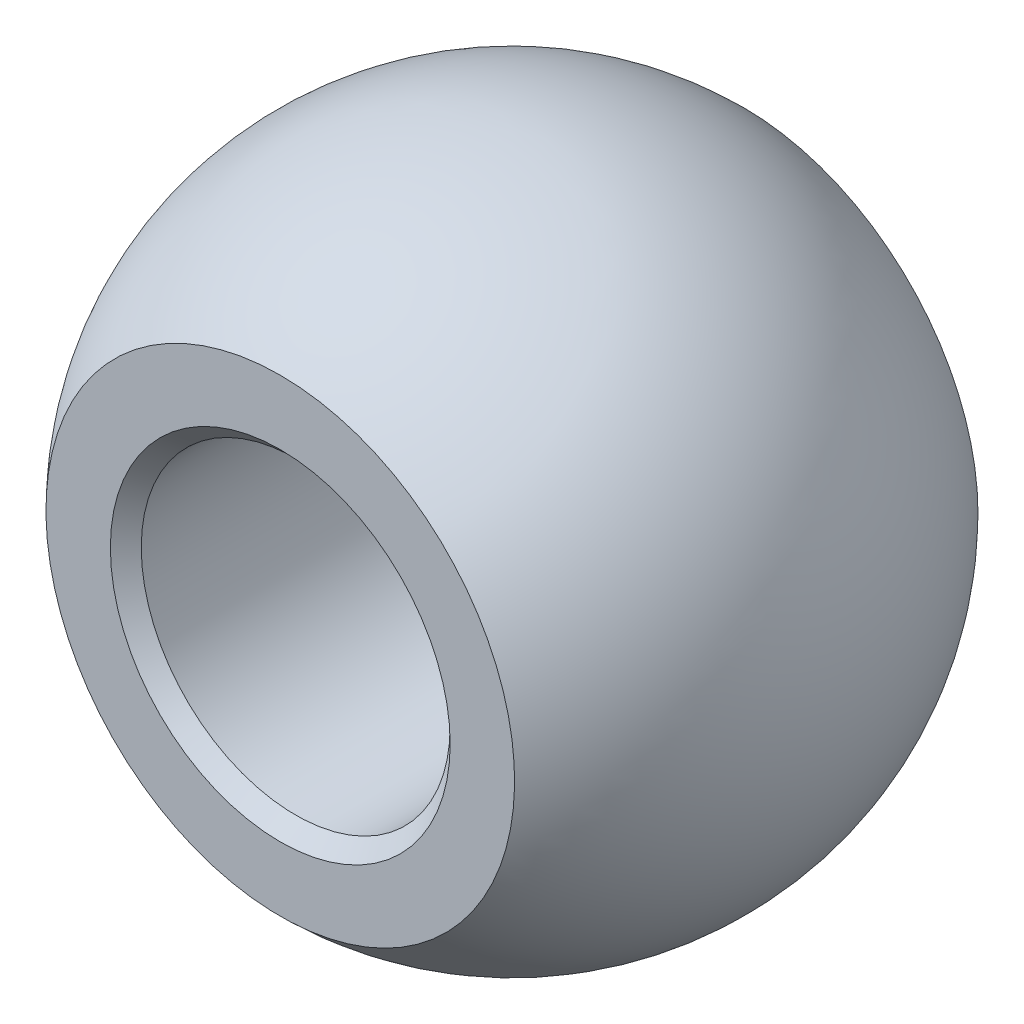
ISO-10303-21;
HEADER;
FILE_DESCRIPTION(('STEP AP214'),'2;1');
FILE_NAME('part.step','',(''),(''),'','','');
FILE_SCHEMA(('AUTOMOTIVE_DESIGN { 1 0 10303 214 1 1 1 1 }'));
ENDSEC;
DATA;
#1=APPLICATION_CONTEXT('core data for automotive mechanical design processes');
#2=APPLICATION_PROTOCOL_DEFINITION('international standard','automotive_design',2000,#1);
#3=PRODUCT_CONTEXT('',#1,'mechanical');
#4=PRODUCT('Part','Part','',(#3));
#5=PRODUCT_RELATED_PRODUCT_CATEGORY('part','',(#4));
#6=PRODUCT_DEFINITION_FORMATION('','',#4);
#7=PRODUCT_DEFINITION_CONTEXT('part definition',#1,'design');
#8=PRODUCT_DEFINITION('design','',#6,#7);
#9=PRODUCT_DEFINITION_SHAPE('','',#8);
#10=(LENGTH_UNIT() NAMED_UNIT(*) SI_UNIT(.MILLI.,.METRE.));
#11=(NAMED_UNIT(*) PLANE_ANGLE_UNIT() SI_UNIT($,.RADIAN.));
#12=(NAMED_UNIT(*) SI_UNIT($,.STERADIAN.) SOLID_ANGLE_UNIT());
#13=UNCERTAINTY_MEASURE_WITH_UNIT(LENGTH_MEASURE(1.E-05),#10,'distance_accuracy_value','');
#14=(GEOMETRIC_REPRESENTATION_CONTEXT(3) GLOBAL_UNCERTAINTY_ASSIGNED_CONTEXT((#13)) GLOBAL_UNIT_ASSIGNED_CONTEXT((#10,
#11,#12)) REPRESENTATION_CONTEXT('',''));
#15=CARTESIAN_POINT('',(0.,0.,0.));
#16=DIRECTION('',(0.,0.,1.));
#17=DIRECTION('',(1.,0.,0.));
#18=AXIS2_PLACEMENT_3D('',#15,#16,#17);
#19=CARTESIAN_POINT('',(0.,0.,0.));
#20=DIRECTION('',(0.,1.,0.));
#21=DIRECTION('',(1.,0.,0.));
#22=AXIS2_PLACEMENT_3D('',#19,#20,#21);
#23=SPHERICAL_SURFACE('',#22,6.4);
#24=CARTESIAN_POINT('',(0.,0.,0.));
#25=DIRECTION('',(0.,0.,-1.));
#26=DIRECTION('',(0.,1.,0.));
#27=AXIS2_PLACEMENT_3D('',#24,#25,#26);
#28=SPHERICAL_SURFACE('',#27,6.4);
#29=CARTESIAN_POINT('',(0.,0.,4.5));
#30=DIRECTION('',(0.,0.,-1.));
#31=DIRECTION('',(0.,1.,0.));
#32=AXIS2_PLACEMENT_3D('',#29,#30,#31);
#33=CIRCLE('',#32,4.5508241011931);
#34=CARTESIAN_POINT('',(0.,4.5508241011931,4.5));
#35=VERTEX_POINT('',#34);
#36=EDGE_CURVE('E53',#35,#35,#33,.F.);
#37=ORIENTED_EDGE('',*,*,#36,.F.);
#38=EDGE_LOOP('',(#37));
#39=FACE_BOUND('',#38,.T.);
#40=CARTESIAN_POINT('',(0.,0.,-4.5));
#41=DIRECTION('',(0.,0.,1.));
#42=DIRECTION('',(0.,-1.,0.));
#43=AXIS2_PLACEMENT_3D('',#40,#41,#42);
#44=CIRCLE('',#43,4.5508241011931);
#45=CARTESIAN_POINT('',(0.,-4.5508241011931,-4.5));
#46=VERTEX_POINT('',#45);
#47=EDGE_CURVE('E52',#46,#46,#44,.F.);
#48=ORIENTED_EDGE('',*,*,#47,.F.);
#49=EDGE_LOOP('',(#48));
#50=FACE_BOUND('',#49,.T.);
#51=ADVANCED_FACE('F32',(#39,#50),#28,.T.);
#52=CARTESIAN_POINT('',(-6.4,7.90827763743701,-4.5));
#53=DIRECTION('',(0.,0.,1.));
#54=DIRECTION('',(0.,-1.,0.));
#55=AXIS2_PLACEMENT_3D('',#52,#53,#54);
#56=PLANE('',#55);
#57=CARTESIAN_POINT('',(0.,0.,-4.5));
#58=DIRECTION('',(0.,0.,1.));
#59=DIRECTION('',(0.,-1.,0.));
#60=AXIS2_PLACEMENT_3D('',#57,#58,#59);
#61=CIRCLE('',#60,3.3);
#62=CARTESIAN_POINT('',(0.,-3.3,-4.5));
#63=VERTEX_POINT('',#62);
#64=EDGE_CURVE('E10',#63,#63,#61,.T.);
#65=ORIENTED_EDGE('',*,*,#64,.T.);
#66=EDGE_LOOP('',(#65));
#67=FACE_BOUND('',#66,.T.);
#68=ORIENTED_EDGE('',*,*,#47,.T.);
#69=EDGE_LOOP('',(#68));
#70=FACE_BOUND('',#69,.T.);
#71=ADVANCED_FACE('F59',(#67,#70),#56,.F.);
#72=CARTESIAN_POINT('',(-6.4,8.45041359442809,4.5));
#73=DIRECTION('',(0.,0.,-1.));
#74=DIRECTION('',(0.,1.,0.));
#75=AXIS2_PLACEMENT_3D('',#72,#73,#74);
#76=PLANE('',#75);
#77=CARTESIAN_POINT('',(0.,0.,4.5));
#78=DIRECTION('',(0.,0.,-1.));
#79=DIRECTION('',(0.,1.,0.));
#80=AXIS2_PLACEMENT_3D('',#77,#78,#79);
#81=CIRCLE('',#80,3.3);
#82=CARTESIAN_POINT('',(0.,3.3,4.5));
#83=VERTEX_POINT('',#82);
#84=EDGE_CURVE('E39',#83,#83,#81,.T.);
#85=ORIENTED_EDGE('',*,*,#84,.T.);
#86=EDGE_LOOP('',(#85));
#87=FACE_BOUND('',#86,.T.);
#88=ORIENTED_EDGE('',*,*,#36,.T.);
#89=EDGE_LOOP('',(#88));
#90=FACE_BOUND('',#89,.T.);
#91=ADVANCED_FACE('F67',(#87,#90),#76,.F.);
#92=CARTESIAN_POINT('',(0.,0.,-4.5));
#93=DIRECTION('',(0.,0.,1.));
#94=DIRECTION('',(1.,0.,0.));
#95=AXIS2_PLACEMENT_3D('',#92,#93,#94);
#96=CYLINDRICAL_SURFACE('',#95,3.);
#97=CARTESIAN_POINT('',(0.,0.,4.2));
#98=DIRECTION('',(0.,0.,-1.));
#99=DIRECTION('',(-1.,0.,0.));
#100=AXIS2_PLACEMENT_3D('',#97,#98,#99);
#101=CIRCLE('',#100,3.);
#102=CARTESIAN_POINT('',(-3.,0.,4.2));
#103=VERTEX_POINT('',#102);
#104=EDGE_CURVE('E43',#103,#103,#101,.F.);
#105=ORIENTED_EDGE('',*,*,#104,.T.);
#106=EDGE_LOOP('',(#105));
#107=FACE_BOUND('',#106,.T.);
#108=CARTESIAN_POINT('',(0.,0.,-4.2));
#109=DIRECTION('',(0.,0.,1.));
#110=DIRECTION('',(1.,0.,0.));
#111=AXIS2_PLACEMENT_3D('',#108,#109,#110);
#112=CIRCLE('',#111,3.);
#113=CARTESIAN_POINT('',(3.,0.,-4.2));
#114=VERTEX_POINT('',#113);
#115=EDGE_CURVE('E47',#114,#114,#112,.F.);
#116=ORIENTED_EDGE('',*,*,#115,.T.);
#117=EDGE_LOOP('',(#116));
#118=FACE_BOUND('',#117,.T.);
#119=ADVANCED_FACE('F73',(#107,#118),#96,.F.);
#120=CARTESIAN_POINT('',(0.,0.,4.2));
#121=DIRECTION('',(0.,0.,1.));
#122=DIRECTION('',(1.,0.,0.));
#123=AXIS2_PLACEMENT_3D('',#120,#121,#122);
#124=CONICAL_SURFACE('',#123,3.,0.785398163397457);
#125=ORIENTED_EDGE('',*,*,#84,.F.);
#126=EDGE_LOOP('',(#125));
#127=FACE_BOUND('',#126,.T.);
#128=ORIENTED_EDGE('',*,*,#104,.F.);
#129=EDGE_LOOP('',(#128));
#130=FACE_BOUND('',#129,.T.);
#131=ADVANCED_FACE('F71',(#127,#130),#124,.F.);
#132=CARTESIAN_POINT('',(0.,0.,-4.5));
#133=DIRECTION('',(0.,0.,-1.));
#134=DIRECTION('',(-1.,0.,0.));
#135=AXIS2_PLACEMENT_3D('',#132,#133,#134);
#136=CONICAL_SURFACE('',#135,3.3,0.785398163397445);
#137=ORIENTED_EDGE('',*,*,#115,.F.);
#138=EDGE_LOOP('',(#137));
#139=FACE_BOUND('',#138,.T.);
#140=ORIENTED_EDGE('',*,*,#64,.F.);
#141=EDGE_LOOP('',(#140));
#142=FACE_BOUND('',#141,.T.);
#143=ADVANCED_FACE('F34',(#139,#142),#136,.F.);
#144=CLOSED_SHELL('',(#51,#71,#91,#119,#131,#143));
#145=MANIFOLD_SOLID_BREP('B2',#144);
#146=ADVANCED_BREP_SHAPE_REPRESENTATION('',(#18,#145),#14);
#147=SHAPE_DEFINITION_REPRESENTATION(#9,#146);
ENDSEC;
END-ISO-10303-21;
